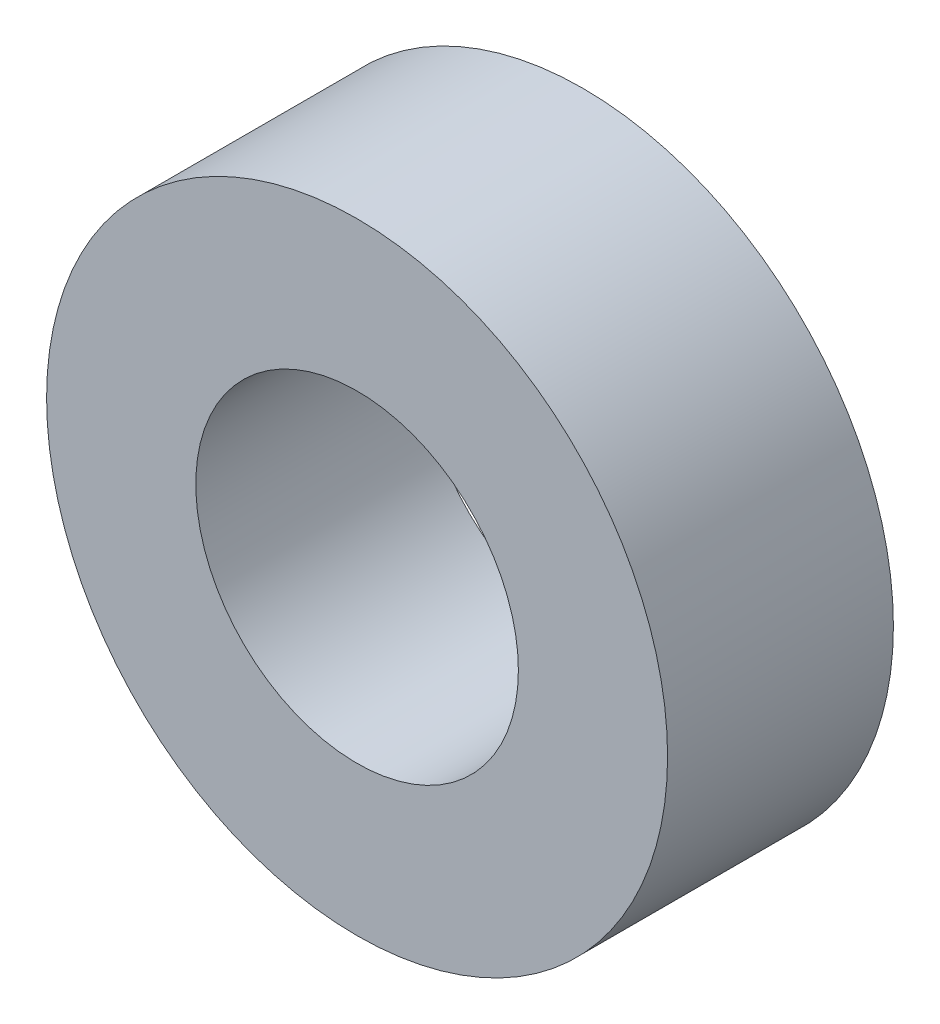
ISO-10303-21;
HEADER;
FILE_DESCRIPTION(('STEP AP214'),'2;1');
FILE_NAME('part.step','',(''),(''),'','','');
FILE_SCHEMA(('AUTOMOTIVE_DESIGN { 1 0 10303 214 1 1 1 1 }'));
ENDSEC;
DATA;
#1=APPLICATION_CONTEXT('core data for automotive mechanical design processes');
#2=APPLICATION_PROTOCOL_DEFINITION('international standard','automotive_design',2000,#1);
#3=PRODUCT_CONTEXT('',#1,'mechanical');
#4=PRODUCT('Part','Part','',(#3));
#5=PRODUCT_RELATED_PRODUCT_CATEGORY('part','',(#4));
#6=PRODUCT_DEFINITION_FORMATION('','',#4);
#7=PRODUCT_DEFINITION_CONTEXT('part definition',#1,'design');
#8=PRODUCT_DEFINITION('design','',#6,#7);
#9=PRODUCT_DEFINITION_SHAPE('','',#8);
#10=(LENGTH_UNIT() NAMED_UNIT(*) SI_UNIT(.MILLI.,.METRE.));
#11=(NAMED_UNIT(*) PLANE_ANGLE_UNIT() SI_UNIT($,.RADIAN.));
#12=(NAMED_UNIT(*) SI_UNIT($,.STERADIAN.) SOLID_ANGLE_UNIT());
#13=UNCERTAINTY_MEASURE_WITH_UNIT(LENGTH_MEASURE(1.E-05),#10,'distance_accuracy_value','');
#14=(GEOMETRIC_REPRESENTATION_CONTEXT(3) GLOBAL_UNCERTAINTY_ASSIGNED_CONTEXT((#13)) GLOBAL_UNIT_ASSIGNED_CONTEXT((#10,
#11,#12)) REPRESENTATION_CONTEXT('',''));
#15=CARTESIAN_POINT('',(0.,0.,0.));
#16=DIRECTION('',(0.,0.,1.));
#17=DIRECTION('',(1.,0.,0.));
#18=AXIS2_PLACEMENT_3D('',#15,#16,#17);
#19=CARTESIAN_POINT('',(0.,0.,2.8));
#20=DIRECTION('',(0.,0.,1.));
#21=DIRECTION('',(1.,0.,0.));
#22=AXIS2_PLACEMENT_3D('',#19,#20,#21);
#23=PLANE('',#22);
#24=CARTESIAN_POINT('',(0.,0.,2.8));
#25=DIRECTION('',(0.,0.,1.));
#26=DIRECTION('',(1.,0.,0.));
#27=AXIS2_PLACEMENT_3D('',#24,#25,#26);
#28=CIRCLE('',#27,3.85);
#29=CARTESIAN_POINT('',(3.85,0.,2.8));
#30=VERTEX_POINT('',#29);
#31=EDGE_CURVE('E10',#30,#30,#28,.T.);
#32=ORIENTED_EDGE('',*,*,#31,.T.);
#33=EDGE_LOOP('',(#32));
#34=FACE_BOUND('',#33,.T.);
#35=CARTESIAN_POINT('',(0.,0.,2.8));
#36=DIRECTION('',(0.,0.,1.));
#37=DIRECTION('',(1.,0.,0.));
#38=AXIS2_PLACEMENT_3D('',#35,#36,#37);
#39=CIRCLE('',#38,2.);
#40=CARTESIAN_POINT('',(2.,0.,2.8));
#41=VERTEX_POINT('',#40);
#42=EDGE_CURVE('E42',#41,#41,#39,.T.);
#43=ORIENTED_EDGE('',*,*,#42,.F.);
#44=EDGE_LOOP('',(#43));
#45=FACE_BOUND('',#44,.T.);
#46=ADVANCED_FACE('F31',(#34,#45),#23,.T.);
#47=CARTESIAN_POINT('',(0.,0.,0.));
#48=DIRECTION('',(0.,0.,1.));
#49=DIRECTION('',(1.,0.,0.));
#50=AXIS2_PLACEMENT_3D('',#47,#48,#49);
#51=PLANE('',#50);
#52=CARTESIAN_POINT('',(0.,0.,0.));
#53=DIRECTION('',(0.,0.,1.));
#54=DIRECTION('',(1.,0.,0.));
#55=AXIS2_PLACEMENT_3D('',#52,#53,#54);
#56=CIRCLE('',#55,3.85);
#57=CARTESIAN_POINT('',(3.85,0.,0.));
#58=VERTEX_POINT('',#57);
#59=EDGE_CURVE('E35',#58,#58,#56,.T.);
#60=ORIENTED_EDGE('',*,*,#59,.F.);
#61=EDGE_LOOP('',(#60));
#62=FACE_BOUND('',#61,.T.);
#63=CARTESIAN_POINT('',(0.,0.,0.));
#64=DIRECTION('',(0.,0.,1.));
#65=DIRECTION('',(1.,0.,0.));
#66=AXIS2_PLACEMENT_3D('',#63,#64,#65);
#67=CIRCLE('',#66,2.);
#68=CARTESIAN_POINT('',(2.,0.,0.));
#69=VERTEX_POINT('',#68);
#70=EDGE_CURVE('E44',#69,#69,#67,.T.);
#71=ORIENTED_EDGE('',*,*,#70,.T.);
#72=EDGE_LOOP('',(#71));
#73=FACE_BOUND('',#72,.T.);
#74=ADVANCED_FACE('F54',(#62,#73),#51,.F.);
#75=CARTESIAN_POINT('',(0.,0.,2.8));
#76=DIRECTION('',(0.,0.,-1.));
#77=DIRECTION('',(-1.,0.,0.));
#78=AXIS2_PLACEMENT_3D('',#75,#76,#77);
#79=CYLINDRICAL_SURFACE('',#78,3.85);
#80=ORIENTED_EDGE('',*,*,#31,.F.);
#81=EDGE_LOOP('',(#80));
#82=FACE_BOUND('',#81,.T.);
#83=ORIENTED_EDGE('',*,*,#59,.T.);
#84=EDGE_LOOP('',(#83));
#85=FACE_BOUND('',#84,.T.);
#86=ADVANCED_FACE('F33',(#82,#85),#79,.T.);
#87=CARTESIAN_POINT('',(0.,0.,2.8));
#88=DIRECTION('',(0.,0.,-1.));
#89=DIRECTION('',(-1.,0.,0.));
#90=AXIS2_PLACEMENT_3D('',#87,#88,#89);
#91=CYLINDRICAL_SURFACE('',#90,2.);
#92=ORIENTED_EDGE('',*,*,#42,.T.);
#93=EDGE_LOOP('',(#92));
#94=FACE_BOUND('',#93,.T.);
#95=ORIENTED_EDGE('',*,*,#70,.F.);
#96=EDGE_LOOP('',(#95));
#97=FACE_BOUND('',#96,.T.);
#98=ADVANCED_FACE('F50',(#94,#97),#91,.F.);
#99=CLOSED_SHELL('',(#46,#74,#86,#98));
#100=MANIFOLD_SOLID_BREP('B2',#99);
#101=ADVANCED_BREP_SHAPE_REPRESENTATION('',(#18,#100),#14);
#102=SHAPE_DEFINITION_REPRESENTATION(#9,#101);
ENDSEC;
END-ISO-10303-21;
